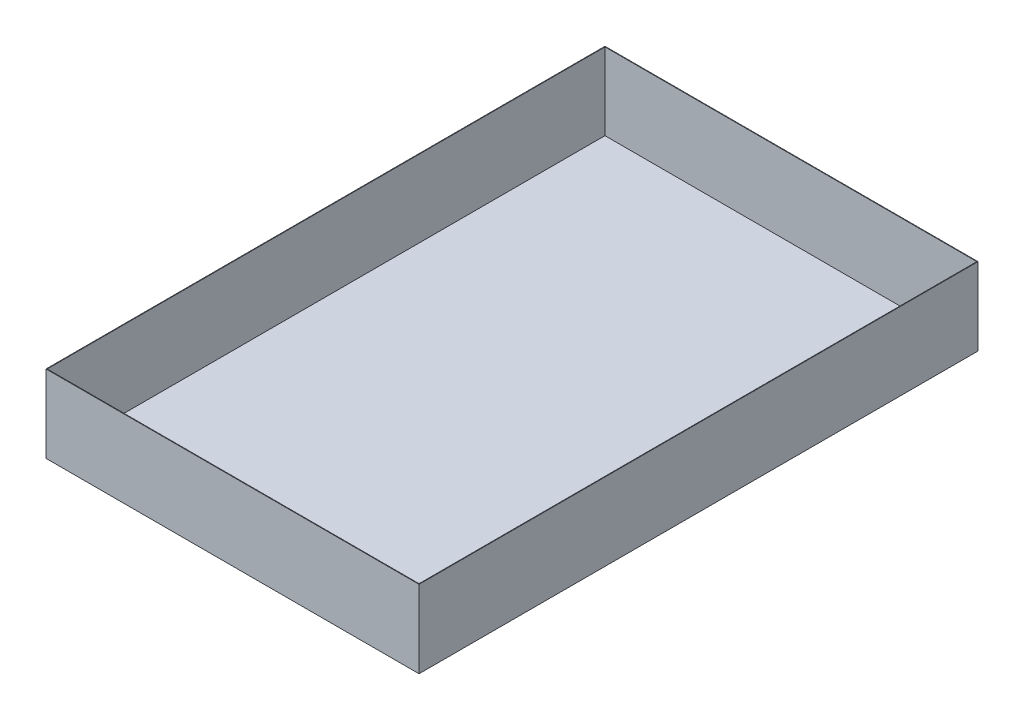
ISO-10303-21;
HEADER;
FILE_DESCRIPTION(('STEP AP214'),'2;1');
FILE_NAME('part.step','',(''),(''),'','','');
FILE_SCHEMA(('AUTOMOTIVE_DESIGN { 1 0 10303 214 1 1 1 1 }'));
ENDSEC;
DATA;
#1=APPLICATION_CONTEXT('core data for automotive mechanical design processes');
#2=APPLICATION_PROTOCOL_DEFINITION('international standard','automotive_design',2000,#1);
#3=PRODUCT_CONTEXT('',#1,'mechanical');
#4=PRODUCT('Part','Part','',(#3));
#5=PRODUCT_RELATED_PRODUCT_CATEGORY('part','',(#4));
#6=PRODUCT_DEFINITION_FORMATION('','',#4);
#7=PRODUCT_DEFINITION_CONTEXT('part definition',#1,'design');
#8=PRODUCT_DEFINITION('design','',#6,#7);
#9=PRODUCT_DEFINITION_SHAPE('','',#8);
#10=(LENGTH_UNIT() NAMED_UNIT(*) SI_UNIT(.MILLI.,.METRE.));
#11=(NAMED_UNIT(*) PLANE_ANGLE_UNIT() SI_UNIT($,.RADIAN.));
#12=(NAMED_UNIT(*) SI_UNIT($,.STERADIAN.) SOLID_ANGLE_UNIT());
#13=UNCERTAINTY_MEASURE_WITH_UNIT(LENGTH_MEASURE(1.E-05),#10,'distance_accuracy_value','');
#14=(GEOMETRIC_REPRESENTATION_CONTEXT(3) GLOBAL_UNCERTAINTY_ASSIGNED_CONTEXT((#13)) GLOBAL_UNIT_ASSIGNED_CONTEXT((#10,
#11,#12)) REPRESENTATION_CONTEXT('',''));
#15=CARTESIAN_POINT('',(0.,0.,0.));
#16=DIRECTION('',(0.,0.,1.));
#17=DIRECTION('',(1.,0.,0.));
#18=AXIS2_PLACEMENT_3D('',#15,#16,#17);
#19=CARTESIAN_POINT('',(240.75,100.,-360.75));
#20=DIRECTION('',(-1.,0.,0.));
#21=DIRECTION('',(0.,0.,1.));
#22=AXIS2_PLACEMENT_3D('',#19,#20,#21);
#23=PLANE('',#22);
#24=DIRECTION('',(0.,0.,-1.));
#25=VECTOR('',#24,1.);
#26=CARTESIAN_POINT('',(240.75,0.,-360.75));
#27=LINE('',#26,#25);
#28=CARTESIAN_POINT('',(240.75,0.,360.75));
#29=VERTEX_POINT('',#28);
#30=CARTESIAN_POINT('',(240.75,0.,-360.75));
#31=VERTEX_POINT('',#30);
#32=EDGE_CURVE('E152',#29,#31,#27,.T.);
#33=ORIENTED_EDGE('',*,*,#32,.T.);
#34=DIRECTION('',(0.,-1.,0.));
#35=VECTOR('',#34,1.);
#36=CARTESIAN_POINT('',(240.75,100.,-360.75));
#37=LINE('',#36,#35);
#38=CARTESIAN_POINT('',(240.75,100.,-360.75));
#39=VERTEX_POINT('',#38);
#40=EDGE_CURVE('E11',#39,#31,#37,.T.);
#41=ORIENTED_EDGE('',*,*,#40,.F.);
#42=DIRECTION('',(0.,0.,-1.));
#43=VECTOR('',#42,1.);
#44=CARTESIAN_POINT('',(240.75,100.,-360.75));
#45=LINE('',#44,#43);
#46=CARTESIAN_POINT('',(240.75,100.,360.75));
#47=VERTEX_POINT('',#46);
#48=EDGE_CURVE('E145',#47,#39,#45,.T.);
#49=ORIENTED_EDGE('',*,*,#48,.F.);
#50=DIRECTION('',(0.,-1.,0.));
#51=VECTOR('',#50,1.);
#52=CARTESIAN_POINT('',(240.75,100.,360.75));
#53=LINE('',#52,#51);
#54=EDGE_CURVE('E151',#47,#29,#53,.T.);
#55=ORIENTED_EDGE('',*,*,#54,.T.);
#56=EDGE_LOOP('',(#33,#41,#49,#55));
#57=FACE_BOUND('',#56,.T.);
#58=ADVANCED_FACE('F38',(#57),#23,.F.);
#59=CARTESIAN_POINT('',(-240.75,100.,-360.75));
#60=DIRECTION('',(0.,0.,1.));
#61=DIRECTION('',(1.,0.,0.));
#62=AXIS2_PLACEMENT_3D('',#59,#60,#61);
#63=PLANE('',#62);
#64=DIRECTION('',(-1.,0.,0.));
#65=VECTOR('',#64,1.);
#66=CARTESIAN_POINT('',(-240.75,0.,-360.75));
#67=LINE('',#66,#65);
#68=CARTESIAN_POINT('',(-240.75,0.,-360.75));
#69=VERTEX_POINT('',#68);
#70=EDGE_CURVE('E155',#31,#69,#67,.T.);
#71=ORIENTED_EDGE('',*,*,#70,.T.);
#72=DIRECTION('',(0.,-1.,0.));
#73=VECTOR('',#72,1.);
#74=CARTESIAN_POINT('',(-240.75,100.,-360.75));
#75=LINE('',#74,#73);
#76=CARTESIAN_POINT('',(-240.75,100.,-360.75));
#77=VERTEX_POINT('',#76);
#78=EDGE_CURVE('E45',#77,#69,#75,.T.);
#79=ORIENTED_EDGE('',*,*,#78,.F.);
#80=DIRECTION('',(-1.,0.,0.));
#81=VECTOR('',#80,1.);
#82=CARTESIAN_POINT('',(-240.75,100.,-360.75));
#83=LINE('',#82,#81);
#84=EDGE_CURVE('E89',#39,#77,#83,.T.);
#85=ORIENTED_EDGE('',*,*,#84,.F.);
#86=ORIENTED_EDGE('',*,*,#40,.T.);
#87=EDGE_LOOP('',(#71,#79,#85,#86));
#88=FACE_BOUND('',#87,.T.);
#89=ADVANCED_FACE('F184',(#88),#63,.F.);
#90=CARTESIAN_POINT('',(-240.75,100.,-360.75));
#91=DIRECTION('',(1.,0.,0.));
#92=DIRECTION('',(0.,0.,-1.));
#93=AXIS2_PLACEMENT_3D('',#90,#91,#92);
#94=PLANE('',#93);
#95=DIRECTION('',(0.,0.,1.));
#96=VECTOR('',#95,1.);
#97=CARTESIAN_POINT('',(-240.75,0.,-360.75));
#98=LINE('',#97,#96);
#99=CARTESIAN_POINT('',(-240.75,0.,360.75));
#100=VERTEX_POINT('',#99);
#101=EDGE_CURVE('E157',#69,#100,#98,.T.);
#102=ORIENTED_EDGE('',*,*,#101,.T.);
#103=DIRECTION('',(0.,-1.,0.));
#104=VECTOR('',#103,1.);
#105=CARTESIAN_POINT('',(-240.75,100.,360.75));
#106=LINE('',#105,#104);
#107=CARTESIAN_POINT('',(-240.75,100.,360.75));
#108=VERTEX_POINT('',#107);
#109=EDGE_CURVE('E161',#108,#100,#106,.T.);
#110=ORIENTED_EDGE('',*,*,#109,.F.);
#111=DIRECTION('',(0.,0.,1.));
#112=VECTOR('',#111,1.);
#113=CARTESIAN_POINT('',(-240.75,100.,-360.75));
#114=LINE('',#113,#112);
#115=EDGE_CURVE('E148',#77,#108,#114,.T.);
#116=ORIENTED_EDGE('',*,*,#115,.F.);
#117=ORIENTED_EDGE('',*,*,#78,.T.);
#118=EDGE_LOOP('',(#102,#110,#116,#117));
#119=FACE_BOUND('',#118,.T.);
#120=ADVANCED_FACE('F166',(#119),#94,.F.);
#121=CARTESIAN_POINT('',(-240.75,100.,360.75));
#122=DIRECTION('',(0.,0.,-1.));
#123=DIRECTION('',(-1.,0.,0.));
#124=AXIS2_PLACEMENT_3D('',#121,#122,#123);
#125=PLANE('',#124);
#126=DIRECTION('',(1.,0.,0.));
#127=VECTOR('',#126,1.);
#128=CARTESIAN_POINT('',(-240.75,0.,360.75));
#129=LINE('',#128,#127);
#130=EDGE_CURVE('E82',#100,#29,#129,.T.);
#131=ORIENTED_EDGE('',*,*,#130,.T.);
#132=ORIENTED_EDGE('',*,*,#54,.F.);
#133=DIRECTION('',(1.,0.,0.));
#134=VECTOR('',#133,1.);
#135=CARTESIAN_POINT('',(-240.75,100.,360.75));
#136=LINE('',#135,#134);
#137=EDGE_CURVE('E61',#108,#47,#136,.T.);
#138=ORIENTED_EDGE('',*,*,#137,.F.);
#139=ORIENTED_EDGE('',*,*,#109,.T.);
#140=EDGE_LOOP('',(#131,#132,#138,#139));
#141=FACE_BOUND('',#140,.T.);
#142=ADVANCED_FACE('F174',(#141),#125,.F.);
#143=CARTESIAN_POINT('',(0.,100.,0.));
#144=DIRECTION('',(0.,1.,0.));
#145=DIRECTION('',(0.,0.,1.));
#146=AXIS2_PLACEMENT_3D('',#143,#144,#145);
#147=PLANE('',#146);
#148=DIRECTION('',(0.,0.,-1.));
#149=VECTOR('',#148,1.);
#150=CARTESIAN_POINT('',(240.,100.,-360.75));
#151=LINE('',#150,#149);
#152=CARTESIAN_POINT('',(240.,100.,360.));
#153=VERTEX_POINT('',#152);
#154=CARTESIAN_POINT('',(240.,100.,-360.));
#155=VERTEX_POINT('',#154);
#156=EDGE_CURVE('E134',#153,#155,#151,.T.);
#157=ORIENTED_EDGE('',*,*,#156,.F.);
#158=DIRECTION('',(1.,0.,0.));
#159=VECTOR('',#158,1.);
#160=CARTESIAN_POINT('',(-240.75,100.,360.));
#161=LINE('',#160,#159);
#162=CARTESIAN_POINT('',(-240.,100.,360.));
#163=VERTEX_POINT('',#162);
#164=EDGE_CURVE('E143',#163,#153,#161,.T.);
#165=ORIENTED_EDGE('',*,*,#164,.F.);
#166=DIRECTION('',(0.,0.,1.));
#167=VECTOR('',#166,1.);
#168=CARTESIAN_POINT('',(-240.,100.,-360.75));
#169=LINE('',#168,#167);
#170=CARTESIAN_POINT('',(-240.,100.,-360.));
#171=VERTEX_POINT('',#170);
#172=EDGE_CURVE('E141',#171,#163,#169,.T.);
#173=ORIENTED_EDGE('',*,*,#172,.F.);
#174=DIRECTION('',(-1.,0.,0.));
#175=VECTOR('',#174,1.);
#176=CARTESIAN_POINT('',(-240.75,100.,-360.));
#177=LINE('',#176,#175);
#178=EDGE_CURVE('E126',#155,#171,#177,.T.);
#179=ORIENTED_EDGE('',*,*,#178,.F.);
#180=EDGE_LOOP('',(#157,#165,#173,#179));
#181=FACE_BOUND('',#180,.T.);
#182=ORIENTED_EDGE('',*,*,#48,.T.);
#183=ORIENTED_EDGE('',*,*,#84,.T.);
#184=ORIENTED_EDGE('',*,*,#115,.T.);
#185=ORIENTED_EDGE('',*,*,#137,.T.);
#186=EDGE_LOOP('',(#182,#183,#184,#185));
#187=FACE_BOUND('',#186,.T.);
#188=ADVANCED_FACE('F176',(#181,#187),#147,.T.);
#189=CARTESIAN_POINT('',(0.,0.,0.));
#190=DIRECTION('',(0.,1.,0.));
#191=DIRECTION('',(0.,0.,1.));
#192=AXIS2_PLACEMENT_3D('',#189,#190,#191);
#193=PLANE('',#192);
#194=CARTESIAN_POINT('',(120.75,0.,310.75));
#195=DIRECTION('',(0.,1.,0.));
#196=DIRECTION('',(0.,0.,1.));
#197=AXIS2_PLACEMENT_3D('',#194,#195,#196);
#198=CIRCLE('',#197,13.5);
#199=CARTESIAN_POINT('',(120.75,0.,324.25));
#200=VERTEX_POINT('',#199);
#201=EDGE_CURVE('E279',#200,#200,#198,.T.);
#202=ORIENTED_EDGE('',*,*,#201,.T.);
#203=EDGE_LOOP('',(#202));
#204=FACE_BOUND('',#203,.T.);
#205=ORIENTED_EDGE('',*,*,#32,.F.);
#206=ORIENTED_EDGE('',*,*,#130,.F.);
#207=ORIENTED_EDGE('',*,*,#101,.F.);
#208=ORIENTED_EDGE('',*,*,#70,.F.);
#209=EDGE_LOOP('',(#205,#206,#207,#208));
#210=FACE_BOUND('',#209,.T.);
#211=ADVANCED_FACE('F170',(#204,#210),#193,.F.);
#212=CARTESIAN_POINT('',(240.,100.,-360.75));
#213=DIRECTION('',(-1.,0.,0.));
#214=DIRECTION('',(0.,0.,1.));
#215=AXIS2_PLACEMENT_3D('',#212,#213,#214);
#216=PLANE('',#215);
#217=DIRECTION('',(0.,0.,-1.));
#218=VECTOR('',#217,1.);
#219=CARTESIAN_POINT('',(240.,0.750000000000001,-360.75));
#220=LINE('',#219,#218);
#221=CARTESIAN_POINT('',(240.,0.75,360.));
#222=VERTEX_POINT('',#221);
#223=CARTESIAN_POINT('',(240.,0.75,-360.));
#224=VERTEX_POINT('',#223);
#225=EDGE_CURVE('E117',#222,#224,#220,.T.);
#226=ORIENTED_EDGE('',*,*,#225,.F.);
#227=DIRECTION('',(0.,-1.,0.));
#228=VECTOR('',#227,1.);
#229=CARTESIAN_POINT('',(240.,100.,360.));
#230=LINE('',#229,#228);
#231=EDGE_CURVE('E137',#153,#222,#230,.T.);
#232=ORIENTED_EDGE('',*,*,#231,.F.);
#233=ORIENTED_EDGE('',*,*,#156,.T.);
#234=DIRECTION('',(0.,-1.,0.));
#235=VECTOR('',#234,1.);
#236=CARTESIAN_POINT('',(240.,100.,-360.));
#237=LINE('',#236,#235);
#238=EDGE_CURVE('E129',#155,#224,#237,.T.);
#239=ORIENTED_EDGE('',*,*,#238,.T.);
#240=EDGE_LOOP('',(#226,#232,#233,#239));
#241=FACE_BOUND('',#240,.T.);
#242=ADVANCED_FACE('F214',(#241),#216,.T.);
#243=CARTESIAN_POINT('',(-240.75,100.,-360.));
#244=DIRECTION('',(0.,0.,1.));
#245=DIRECTION('',(1.,0.,0.));
#246=AXIS2_PLACEMENT_3D('',#243,#244,#245);
#247=PLANE('',#246);
#248=DIRECTION('',(-1.,0.,0.));
#249=VECTOR('',#248,1.);
#250=CARTESIAN_POINT('',(-240.75,0.750000000000001,-360.));
#251=LINE('',#250,#249);
#252=CARTESIAN_POINT('',(-240.,0.75,-360.));
#253=VERTEX_POINT('',#252);
#254=EDGE_CURVE('E111',#224,#253,#251,.T.);
#255=ORIENTED_EDGE('',*,*,#254,.F.);
#256=ORIENTED_EDGE('',*,*,#238,.F.);
#257=ORIENTED_EDGE('',*,*,#178,.T.);
#258=DIRECTION('',(0.,-1.,0.));
#259=VECTOR('',#258,1.);
#260=CARTESIAN_POINT('',(-240.,100.,-360.));
#261=LINE('',#260,#259);
#262=EDGE_CURVE('E123',#171,#253,#261,.T.);
#263=ORIENTED_EDGE('',*,*,#262,.T.);
#264=EDGE_LOOP('',(#255,#256,#257,#263));
#265=FACE_BOUND('',#264,.T.);
#266=ADVANCED_FACE('F124',(#265),#247,.T.);
#267=CARTESIAN_POINT('',(-240.,100.,-360.75));
#268=DIRECTION('',(1.,0.,0.));
#269=DIRECTION('',(0.,0.,-1.));
#270=AXIS2_PLACEMENT_3D('',#267,#268,#269);
#271=PLANE('',#270);
#272=DIRECTION('',(0.,0.,1.));
#273=VECTOR('',#272,1.);
#274=CARTESIAN_POINT('',(-240.,0.750000000000001,-360.75));
#275=LINE('',#274,#273);
#276=CARTESIAN_POINT('',(-240.,0.75,360.));
#277=VERTEX_POINT('',#276);
#278=EDGE_CURVE('E115',#253,#277,#275,.T.);
#279=ORIENTED_EDGE('',*,*,#278,.F.);
#280=ORIENTED_EDGE('',*,*,#262,.F.);
#281=ORIENTED_EDGE('',*,*,#172,.T.);
#282=DIRECTION('',(0.,-1.,0.));
#283=VECTOR('',#282,1.);
#284=CARTESIAN_POINT('',(-240.,100.,360.));
#285=LINE('',#284,#283);
#286=EDGE_CURVE('E52',#163,#277,#285,.T.);
#287=ORIENTED_EDGE('',*,*,#286,.T.);
#288=EDGE_LOOP('',(#279,#280,#281,#287));
#289=FACE_BOUND('',#288,.T.);
#290=ADVANCED_FACE('F131',(#289),#271,.T.);
#291=CARTESIAN_POINT('',(-240.75,100.,360.));
#292=DIRECTION('',(0.,0.,-1.));
#293=DIRECTION('',(-1.,0.,0.));
#294=AXIS2_PLACEMENT_3D('',#291,#292,#293);
#295=PLANE('',#294);
#296=DIRECTION('',(1.,0.,0.));
#297=VECTOR('',#296,1.);
#298=CARTESIAN_POINT('',(-240.75,0.750000000000001,360.));
#299=LINE('',#298,#297);
#300=EDGE_CURVE('E132',#277,#222,#299,.T.);
#301=ORIENTED_EDGE('',*,*,#300,.F.);
#302=ORIENTED_EDGE('',*,*,#286,.F.);
#303=ORIENTED_EDGE('',*,*,#164,.T.);
#304=ORIENTED_EDGE('',*,*,#231,.T.);
#305=EDGE_LOOP('',(#301,#302,#303,#304));
#306=FACE_BOUND('',#305,.T.);
#307=ADVANCED_FACE('F236',(#306),#295,.T.);
#308=CARTESIAN_POINT('',(0.,0.75,0.));
#309=DIRECTION('',(0.,1.,0.));
#310=DIRECTION('',(0.,0.,1.));
#311=AXIS2_PLACEMENT_3D('',#308,#309,#310);
#312=PLANE('',#311);
#313=CARTESIAN_POINT('',(120.75,0.75,310.75));
#314=DIRECTION('',(0.,1.,0.));
#315=DIRECTION('',(0.,0.,1.));
#316=AXIS2_PLACEMENT_3D('',#313,#314,#315);
#317=CIRCLE('',#316,13.5);
#318=CARTESIAN_POINT('',(120.75,0.75,324.25));
#319=VERTEX_POINT('',#318);
#320=EDGE_CURVE('E276',#319,#319,#317,.T.);
#321=ORIENTED_EDGE('',*,*,#320,.F.);
#322=EDGE_LOOP('',(#321));
#323=FACE_BOUND('',#322,.T.);
#324=ORIENTED_EDGE('',*,*,#225,.T.);
#325=ORIENTED_EDGE('',*,*,#254,.T.);
#326=ORIENTED_EDGE('',*,*,#278,.T.);
#327=ORIENTED_EDGE('',*,*,#300,.T.);
#328=EDGE_LOOP('',(#324,#325,#326,#327));
#329=FACE_BOUND('',#328,.T.);
#330=ADVANCED_FACE('F113',(#323,#329),#312,.T.);
#331=CARTESIAN_POINT('',(120.75,-9.25,310.75));
#332=DIRECTION('',(0.,1.,0.));
#333=DIRECTION('',(0.,0.,1.));
#334=AXIS2_PLACEMENT_3D('',#331,#332,#333);
#335=CYLINDRICAL_SURFACE('',#334,13.5);
#336=ORIENTED_EDGE('',*,*,#320,.T.);
#337=EDGE_LOOP('',(#336));
#338=FACE_BOUND('',#337,.T.);
#339=ORIENTED_EDGE('',*,*,#201,.F.);
#340=EDGE_LOOP('',(#339));
#341=FACE_BOUND('',#340,.T.);
#342=ADVANCED_FACE('F259',(#338,#341),#335,.F.);
#343=CLOSED_SHELL('',(#58,#89,#120,#142,#188,#211,#242,#266,#290,#307,#330,#342));
#344=MANIFOLD_SOLID_BREP('B2',#343);
#345=ADVANCED_BREP_SHAPE_REPRESENTATION('',(#18,#344),#14);
#346=SHAPE_DEFINITION_REPRESENTATION(#9,#345);
ENDSEC;
END-ISO-10303-21;
